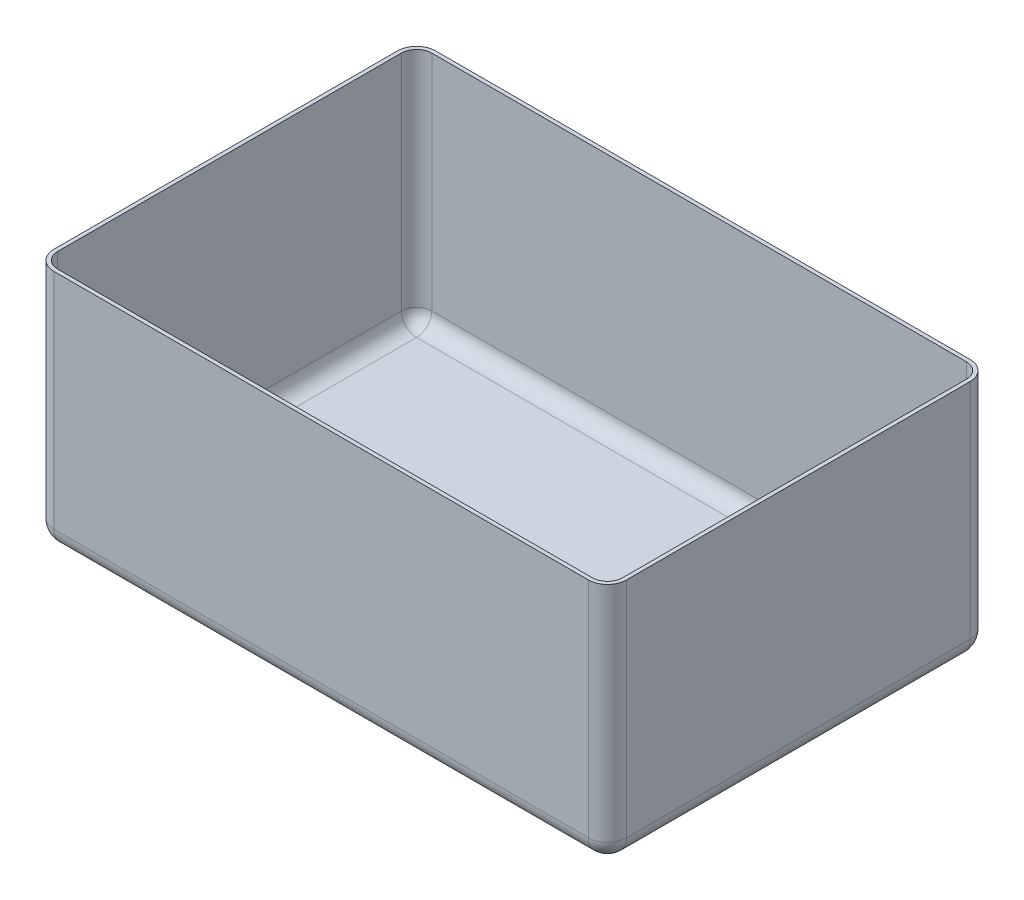
ISO-10303-21;
HEADER;
FILE_DESCRIPTION(('STEP AP214'),'2;1');
FILE_NAME('part.step','',(''),(''),'','','');
FILE_SCHEMA(('AUTOMOTIVE_DESIGN { 1 0 10303 214 1 1 1 1 }'));
ENDSEC;
DATA;
#1=APPLICATION_CONTEXT('core data for automotive mechanical design processes');
#2=APPLICATION_PROTOCOL_DEFINITION('international standard','automotive_design',2000,#1);
#3=PRODUCT_CONTEXT('',#1,'mechanical');
#4=PRODUCT('Part','Part','',(#3));
#5=PRODUCT_RELATED_PRODUCT_CATEGORY('part','',(#4));
#6=PRODUCT_DEFINITION_FORMATION('','',#4);
#7=PRODUCT_DEFINITION_CONTEXT('part definition',#1,'design');
#8=PRODUCT_DEFINITION('design','',#6,#7);
#9=PRODUCT_DEFINITION_SHAPE('','',#8);
#10=(LENGTH_UNIT() NAMED_UNIT(*) SI_UNIT(.MILLI.,.METRE.));
#11=(NAMED_UNIT(*) PLANE_ANGLE_UNIT() SI_UNIT($,.RADIAN.));
#12=(NAMED_UNIT(*) SI_UNIT($,.STERADIAN.) SOLID_ANGLE_UNIT());
#13=UNCERTAINTY_MEASURE_WITH_UNIT(LENGTH_MEASURE(1.E-05),#10,'distance_accuracy_value','');
#14=(GEOMETRIC_REPRESENTATION_CONTEXT(3) GLOBAL_UNCERTAINTY_ASSIGNED_CONTEXT((#13)) GLOBAL_UNIT_ASSIGNED_CONTEXT((#10,
#11,#12)) REPRESENTATION_CONTEXT('',''));
#15=CARTESIAN_POINT('',(0.,0.,0.));
#16=DIRECTION('',(0.,0.,1.));
#17=DIRECTION('',(1.,0.,0.));
#18=AXIS2_PLACEMENT_3D('',#15,#16,#17);
#19=CARTESIAN_POINT('',(0.,127.,0.));
#20=DIRECTION('',(0.,-1.,0.));
#21=DIRECTION('',(0.,0.,-1.));
#22=AXIS2_PLACEMENT_3D('',#19,#20,#21);
#23=PLANE('',#22);
#24=DIRECTION('',(-1.,0.,0.));
#25=VECTOR('',#24,1.);
#26=CARTESIAN_POINT('',(150.,127.,100.));
#27=LINE('',#26,#25);
#28=CARTESIAN_POINT('',(140.,127.,100.));
#29=VERTEX_POINT('',#28);
#30=CARTESIAN_POINT('',(-140.,127.,100.));
#31=VERTEX_POINT('',#30);
#32=EDGE_CURVE('E284',#29,#31,#27,.T.);
#33=ORIENTED_EDGE('',*,*,#32,.F.);
#34=CARTESIAN_POINT('',(140.,127.,90.));
#35=DIRECTION('',(0.,-1.,0.));
#36=DIRECTION('',(0.,0.,-1.));
#37=AXIS2_PLACEMENT_3D('',#34,#35,#36);
#38=CIRCLE('',#37,10.);
#39=CARTESIAN_POINT('',(150.,127.,90.));
#40=VERTEX_POINT('',#39);
#41=EDGE_CURVE('E11',#29,#40,#38,.F.);
#42=ORIENTED_EDGE('',*,*,#41,.T.);
#43=DIRECTION('',(0.,0.,-1.));
#44=VECTOR('',#43,1.);
#45=CARTESIAN_POINT('',(150.,127.,100.));
#46=LINE('',#45,#44);
#47=CARTESIAN_POINT('',(150.,127.,-90.));
#48=VERTEX_POINT('',#47);
#49=EDGE_CURVE('E287',#40,#48,#46,.T.);
#50=ORIENTED_EDGE('',*,*,#49,.T.);
#51=CARTESIAN_POINT('',(140.,127.,-90.));
#52=DIRECTION('',(0.,-1.,0.));
#53=DIRECTION('',(0.,0.,-1.));
#54=AXIS2_PLACEMENT_3D('',#51,#52,#53);
#55=CIRCLE('',#54,10.);
#56=CARTESIAN_POINT('',(140.,127.,-100.));
#57=VERTEX_POINT('',#56);
#58=EDGE_CURVE('E42',#48,#57,#55,.F.);
#59=ORIENTED_EDGE('',*,*,#58,.T.);
#60=DIRECTION('',(-1.,0.,0.));
#61=VECTOR('',#60,1.);
#62=CARTESIAN_POINT('',(150.,127.,-100.));
#63=LINE('',#62,#61);
#64=CARTESIAN_POINT('',(-140.,127.,-100.));
#65=VERTEX_POINT('',#64);
#66=EDGE_CURVE('E278',#57,#65,#63,.T.);
#67=ORIENTED_EDGE('',*,*,#66,.T.);
#68=CARTESIAN_POINT('',(-140.,127.,-90.));
#69=DIRECTION('',(0.,-1.,0.));
#70=DIRECTION('',(0.,0.,-1.));
#71=AXIS2_PLACEMENT_3D('',#68,#69,#70);
#72=CIRCLE('',#71,10.);
#73=CARTESIAN_POINT('',(-150.,127.,-90.));
#74=VERTEX_POINT('',#73);
#75=EDGE_CURVE('E325',#65,#74,#72,.F.);
#76=ORIENTED_EDGE('',*,*,#75,.T.);
#77=DIRECTION('',(0.,0.,-1.));
#78=VECTOR('',#77,1.);
#79=CARTESIAN_POINT('',(-150.,127.,100.));
#80=LINE('',#79,#78);
#81=CARTESIAN_POINT('',(-150.,127.,90.));
#82=VERTEX_POINT('',#81);
#83=EDGE_CURVE('E281',#82,#74,#80,.T.);
#84=ORIENTED_EDGE('',*,*,#83,.F.);
#85=CARTESIAN_POINT('',(-140.,127.,90.));
#86=DIRECTION('',(0.,-1.,0.));
#87=DIRECTION('',(0.,0.,-1.));
#88=AXIS2_PLACEMENT_3D('',#85,#86,#87);
#89=CIRCLE('',#88,10.);
#90=EDGE_CURVE('E323',#82,#31,#89,.F.);
#91=ORIENTED_EDGE('',*,*,#90,.T.);
#92=EDGE_LOOP('',(#33,#42,#50,#59,#67,#76,#84,#91));
#93=FACE_BOUND('',#92,.T.);
#94=CARTESIAN_POINT('',(140.,127.,90.));
#95=DIRECTION('',(0.,-1.,0.));
#96=DIRECTION('',(0.,0.,-1.));
#97=AXIS2_PLACEMENT_3D('',#94,#95,#96);
#98=CIRCLE('',#97,8.);
#99=CARTESIAN_POINT('',(140.,127.,98.));
#100=VERTEX_POINT('',#99);
#101=CARTESIAN_POINT('',(148.,127.,90.));
#102=VERTEX_POINT('',#101);
#103=EDGE_CURVE('E272',#100,#102,#98,.F.);
#104=ORIENTED_EDGE('',*,*,#103,.F.);
#105=DIRECTION('',(-1.,0.,0.));
#106=VECTOR('',#105,1.);
#107=CARTESIAN_POINT('',(0.,127.,98.));
#108=LINE('',#107,#106);
#109=CARTESIAN_POINT('',(-140.,127.,98.));
#110=VERTEX_POINT('',#109);
#111=EDGE_CURVE('E268',#100,#110,#108,.T.);
#112=ORIENTED_EDGE('',*,*,#111,.T.);
#113=CARTESIAN_POINT('',(-140.,127.,90.));
#114=DIRECTION('',(0.,-1.,0.));
#115=DIRECTION('',(0.,0.,-1.));
#116=AXIS2_PLACEMENT_3D('',#113,#114,#115);
#117=CIRCLE('',#116,8.);
#118=CARTESIAN_POINT('',(-148.,127.,90.));
#119=VERTEX_POINT('',#118);
#120=EDGE_CURVE('E184',#119,#110,#117,.F.);
#121=ORIENTED_EDGE('',*,*,#120,.F.);
#122=DIRECTION('',(0.,0.,-1.));
#123=VECTOR('',#122,1.);
#124=CARTESIAN_POINT('',(-148.,127.,0.));
#125=LINE('',#124,#123);
#126=CARTESIAN_POINT('',(-148.,127.,-90.));
#127=VERTEX_POINT('',#126);
#128=EDGE_CURVE('E50',#119,#127,#125,.T.);
#129=ORIENTED_EDGE('',*,*,#128,.T.);
#130=CARTESIAN_POINT('',(-140.,127.,-90.));
#131=DIRECTION('',(0.,-1.,0.));
#132=DIRECTION('',(0.,0.,-1.));
#133=AXIS2_PLACEMENT_3D('',#130,#131,#132);
#134=CIRCLE('',#133,8.);
#135=CARTESIAN_POINT('',(-140.,127.,-98.));
#136=VERTEX_POINT('',#135);
#137=EDGE_CURVE('E265',#136,#127,#134,.F.);
#138=ORIENTED_EDGE('',*,*,#137,.F.);
#139=DIRECTION('',(-1.,0.,0.));
#140=VECTOR('',#139,1.);
#141=CARTESIAN_POINT('',(0.,127.,-98.));
#142=LINE('',#141,#140);
#143=CARTESIAN_POINT('',(140.,127.,-98.));
#144=VERTEX_POINT('',#143);
#145=EDGE_CURVE('E224',#144,#136,#142,.T.);
#146=ORIENTED_EDGE('',*,*,#145,.F.);
#147=CARTESIAN_POINT('',(140.,127.,-90.));
#148=DIRECTION('',(0.,-1.,0.));
#149=DIRECTION('',(0.,0.,-1.));
#150=AXIS2_PLACEMENT_3D('',#147,#148,#149);
#151=CIRCLE('',#150,8.);
#152=CARTESIAN_POINT('',(148.,127.,-90.));
#153=VERTEX_POINT('',#152);
#154=EDGE_CURVE('E179',#153,#144,#151,.F.);
#155=ORIENTED_EDGE('',*,*,#154,.F.);
#156=DIRECTION('',(0.,0.,-1.));
#157=VECTOR('',#156,1.);
#158=CARTESIAN_POINT('',(148.,127.,0.));
#159=LINE('',#158,#157);
#160=EDGE_CURVE('E242',#102,#153,#159,.T.);
#161=ORIENTED_EDGE('',*,*,#160,.F.);
#162=EDGE_LOOP('',(#104,#112,#121,#129,#138,#146,#155,#161));
#163=FACE_BOUND('',#162,.T.);
#164=ADVANCED_FACE('F33',(#93,#163),#23,.F.);
#165=CARTESIAN_POINT('',(150.,127.,-100.));
#166=DIRECTION('',(0.,0.,1.));
#167=DIRECTION('',(1.,0.,0.));
#168=AXIS2_PLACEMENT_3D('',#165,#166,#167);
#169=PLANE('',#168);
#170=ORIENTED_EDGE('',*,*,#66,.F.);
#171=DIRECTION('',(0.,-1.,0.));
#172=VECTOR('',#171,1.);
#173=CARTESIAN_POINT('',(140.,127.,-100.));
#174=LINE('',#173,#172);
#175=CARTESIAN_POINT('',(140.,9.99999999999999,-100.));
#176=VERTEX_POINT('',#175);
#177=EDGE_CURVE('E58',#57,#176,#174,.T.);
#178=ORIENTED_EDGE('',*,*,#177,.T.);
#179=DIRECTION('',(-1.,0.,0.));
#180=VECTOR('',#179,1.);
#181=CARTESIAN_POINT('',(-150.,9.99999999999999,-100.));
#182=LINE('',#181,#180);
#183=CARTESIAN_POINT('',(-140.,9.99999999999999,-100.));
#184=VERTEX_POINT('',#183);
#185=EDGE_CURVE('E320',#176,#184,#182,.T.);
#186=ORIENTED_EDGE('',*,*,#185,.T.);
#187=DIRECTION('',(0.,-1.,0.));
#188=VECTOR('',#187,1.);
#189=CARTESIAN_POINT('',(-140.,127.,-100.));
#190=LINE('',#189,#188);
#191=EDGE_CURVE('E318',#184,#65,#190,.F.);
#192=ORIENTED_EDGE('',*,*,#191,.T.);
#193=EDGE_LOOP('',(#170,#178,#186,#192));
#194=FACE_BOUND('',#193,.T.);
#195=ADVANCED_FACE('F393',(#194),#169,.F.);
#196=CARTESIAN_POINT('',(-150.,127.,100.));
#197=DIRECTION('',(-1.,0.,0.));
#198=DIRECTION('',(0.,0.,1.));
#199=AXIS2_PLACEMENT_3D('',#196,#197,#198);
#200=PLANE('',#199);
#201=ORIENTED_EDGE('',*,*,#83,.T.);
#202=DIRECTION('',(0.,-1.,0.));
#203=VECTOR('',#202,1.);
#204=CARTESIAN_POINT('',(-150.,0.,-90.));
#205=LINE('',#204,#203);
#206=CARTESIAN_POINT('',(-150.,10.,-90.));
#207=VERTEX_POINT('',#206);
#208=EDGE_CURVE('E304',#74,#207,#205,.T.);
#209=ORIENTED_EDGE('',*,*,#208,.T.);
#210=DIRECTION('',(0.,0.,-1.));
#211=VECTOR('',#210,1.);
#212=CARTESIAN_POINT('',(-150.,9.99999999999999,100.));
#213=LINE('',#212,#211);
#214=CARTESIAN_POINT('',(-150.,10.,90.));
#215=VERTEX_POINT('',#214);
#216=EDGE_CURVE('E301',#207,#215,#213,.F.);
#217=ORIENTED_EDGE('',*,*,#216,.T.);
#218=DIRECTION('',(0.,-1.,0.));
#219=VECTOR('',#218,1.);
#220=CARTESIAN_POINT('',(-150.,127.,90.));
#221=LINE('',#220,#219);
#222=EDGE_CURVE('E299',#215,#82,#221,.F.);
#223=ORIENTED_EDGE('',*,*,#222,.T.);
#224=EDGE_LOOP('',(#201,#209,#217,#223));
#225=FACE_BOUND('',#224,.T.);
#226=ADVANCED_FACE('F410',(#225),#200,.T.);
#227=CARTESIAN_POINT('',(150.,127.,100.));
#228=DIRECTION('',(0.,0.,1.));
#229=DIRECTION('',(1.,0.,0.));
#230=AXIS2_PLACEMENT_3D('',#227,#228,#229);
#231=PLANE('',#230);
#232=DIRECTION('',(-1.,0.,0.));
#233=VECTOR('',#232,1.);
#234=CARTESIAN_POINT('',(150.,9.99999999999999,100.));
#235=LINE('',#234,#233);
#236=CARTESIAN_POINT('',(-140.,10.,100.));
#237=VERTEX_POINT('',#236);
#238=CARTESIAN_POINT('',(140.,10.,100.));
#239=VERTEX_POINT('',#238);
#240=EDGE_CURVE('E308',#237,#239,#235,.F.);
#241=ORIENTED_EDGE('',*,*,#240,.T.);
#242=DIRECTION('',(0.,-1.,0.));
#243=VECTOR('',#242,1.);
#244=CARTESIAN_POINT('',(140.,127.,100.));
#245=LINE('',#244,#243);
#246=EDGE_CURVE('E310',#239,#29,#245,.F.);
#247=ORIENTED_EDGE('',*,*,#246,.T.);
#248=ORIENTED_EDGE('',*,*,#32,.T.);
#249=DIRECTION('',(0.,-1.,0.));
#250=VECTOR('',#249,1.);
#251=CARTESIAN_POINT('',(-140.,127.,100.));
#252=LINE('',#251,#250);
#253=EDGE_CURVE('E306',#31,#237,#252,.T.);
#254=ORIENTED_EDGE('',*,*,#253,.T.);
#255=EDGE_LOOP('',(#241,#247,#248,#254));
#256=FACE_BOUND('',#255,.T.);
#257=ADVANCED_FACE('F418',(#256),#231,.T.);
#258=CARTESIAN_POINT('',(150.,127.,100.));
#259=DIRECTION('',(-1.,0.,0.));
#260=DIRECTION('',(0.,0.,1.));
#261=AXIS2_PLACEMENT_3D('',#258,#259,#260);
#262=PLANE('',#261);
#263=ORIENTED_EDGE('',*,*,#49,.F.);
#264=DIRECTION('',(0.,-1.,0.));
#265=VECTOR('',#264,1.);
#266=CARTESIAN_POINT('',(150.,0.,90.));
#267=LINE('',#266,#265);
#268=CARTESIAN_POINT('',(150.,9.99999999999999,90.));
#269=VERTEX_POINT('',#268);
#270=EDGE_CURVE('E316',#40,#269,#267,.T.);
#271=ORIENTED_EDGE('',*,*,#270,.T.);
#272=DIRECTION('',(0.,0.,-1.));
#273=VECTOR('',#272,1.);
#274=CARTESIAN_POINT('',(150.,9.99999999999999,-100.));
#275=LINE('',#274,#273);
#276=CARTESIAN_POINT('',(150.,9.99999999999999,-90.));
#277=VERTEX_POINT('',#276);
#278=EDGE_CURVE('E314',#269,#277,#275,.T.);
#279=ORIENTED_EDGE('',*,*,#278,.T.);
#280=DIRECTION('',(0.,-1.,0.));
#281=VECTOR('',#280,1.);
#282=CARTESIAN_POINT('',(150.,127.,-90.));
#283=LINE('',#282,#281);
#284=EDGE_CURVE('E312',#277,#48,#283,.F.);
#285=ORIENTED_EDGE('',*,*,#284,.T.);
#286=EDGE_LOOP('',(#263,#271,#279,#285));
#287=FACE_BOUND('',#286,.T.);
#288=ADVANCED_FACE('F384',(#287),#262,.F.);
#289=CARTESIAN_POINT('',(0.,0.,0.));
#290=DIRECTION('',(0.,-1.,0.));
#291=DIRECTION('',(0.,0.,-1.));
#292=AXIS2_PLACEMENT_3D('',#289,#290,#291);
#293=PLANE('',#292);
#294=DIRECTION('',(-1.,0.,0.));
#295=VECTOR('',#294,1.);
#296=CARTESIAN_POINT('',(0.,0.,90.));
#297=LINE('',#296,#295);
#298=CARTESIAN_POINT('',(140.,0.,90.));
#299=VERTEX_POINT('',#298);
#300=CARTESIAN_POINT('',(-140.,0.,90.));
#301=VERTEX_POINT('',#300);
#302=EDGE_CURVE('E294',#299,#301,#297,.T.);
#303=ORIENTED_EDGE('',*,*,#302,.T.);
#304=DIRECTION('',(0.,0.,-1.));
#305=VECTOR('',#304,1.);
#306=CARTESIAN_POINT('',(-140.,0.,0.));
#307=LINE('',#306,#305);
#308=CARTESIAN_POINT('',(-140.,0.,-90.));
#309=VERTEX_POINT('',#308);
#310=EDGE_CURVE('E296',#301,#309,#307,.T.);
#311=ORIENTED_EDGE('',*,*,#310,.T.);
#312=DIRECTION('',(-1.,0.,0.));
#313=VECTOR('',#312,1.);
#314=CARTESIAN_POINT('',(150.,0.,-90.));
#315=LINE('',#314,#313);
#316=CARTESIAN_POINT('',(140.,0.,-90.));
#317=VERTEX_POINT('',#316);
#318=EDGE_CURVE('E290',#309,#317,#315,.F.);
#319=ORIENTED_EDGE('',*,*,#318,.T.);
#320=DIRECTION('',(0.,0.,-1.));
#321=VECTOR('',#320,1.);
#322=CARTESIAN_POINT('',(140.,0.,100.));
#323=LINE('',#322,#321);
#324=EDGE_CURVE('E292',#317,#299,#323,.F.);
#325=ORIENTED_EDGE('',*,*,#324,.T.);
#326=EDGE_LOOP('',(#303,#311,#319,#325));
#327=FACE_BOUND('',#326,.T.);
#328=ADVANCED_FACE('F373',(#327),#293,.T.);
#329=CARTESIAN_POINT('',(140.,127.,90.));
#330=DIRECTION('',(0.,1.,0.));
#331=DIRECTION('',(0.,0.,1.));
#332=AXIS2_PLACEMENT_3D('',#329,#330,#331);
#333=CYLINDRICAL_SURFACE('',#332,10.);
#334=ORIENTED_EDGE('',*,*,#41,.F.);
#335=ORIENTED_EDGE('',*,*,#246,.F.);
#336=CARTESIAN_POINT('',(140.,9.99999999999999,90.));
#337=DIRECTION('',(0.,-1.,0.));
#338=DIRECTION('',(0.,0.,-1.));
#339=AXIS2_PLACEMENT_3D('',#336,#337,#338);
#340=CIRCLE('',#339,10.);
#341=EDGE_CURVE('E37',#269,#239,#340,.T.);
#342=ORIENTED_EDGE('',*,*,#341,.F.);
#343=ORIENTED_EDGE('',*,*,#270,.F.);
#344=EDGE_LOOP('',(#334,#335,#342,#343));
#345=FACE_BOUND('',#344,.T.);
#346=ADVANCED_FACE('F35',(#345),#333,.T.);
#347=CARTESIAN_POINT('',(140.,9.99999999999999,100.));
#348=DIRECTION('',(0.,0.,1.));
#349=DIRECTION('',(1.,0.,0.));
#350=AXIS2_PLACEMENT_3D('',#347,#348,#349);
#351=CYLINDRICAL_SURFACE('',#350,10.);
#352=CARTESIAN_POINT('',(140.,9.99999999999999,-90.));
#353=DIRECTION('',(0.,0.,-1.));
#354=DIRECTION('',(-1.,0.,0.));
#355=AXIS2_PLACEMENT_3D('',#352,#353,#354);
#356=CIRCLE('',#355,10.);
#357=EDGE_CURVE('E352',#277,#317,#356,.T.);
#358=ORIENTED_EDGE('',*,*,#357,.F.);
#359=ORIENTED_EDGE('',*,*,#278,.F.);
#360=CARTESIAN_POINT('',(140.,10.,90.));
#361=DIRECTION('',(0.,0.,1.));
#362=DIRECTION('',(1.,0.,0.));
#363=AXIS2_PLACEMENT_3D('',#360,#361,#362);
#364=CIRCLE('',#363,10.);
#365=EDGE_CURVE('E354',#299,#269,#364,.T.);
#366=ORIENTED_EDGE('',*,*,#365,.F.);
#367=ORIENTED_EDGE('',*,*,#324,.F.);
#368=EDGE_LOOP('',(#358,#359,#366,#367));
#369=FACE_BOUND('',#368,.T.);
#370=ADVANCED_FACE('F380',(#369),#351,.T.);
#371=CARTESIAN_POINT('',(140.,127.,-90.));
#372=DIRECTION('',(0.,-1.,0.));
#373=DIRECTION('',(0.,0.,-1.));
#374=AXIS2_PLACEMENT_3D('',#371,#372,#373);
#375=CYLINDRICAL_SURFACE('',#374,10.);
#376=ORIENTED_EDGE('',*,*,#58,.F.);
#377=ORIENTED_EDGE('',*,*,#284,.F.);
#378=CARTESIAN_POINT('',(140.,9.99999999999999,-90.));
#379=DIRECTION('',(0.,-1.,0.));
#380=DIRECTION('',(0.,0.,-1.));
#381=AXIS2_PLACEMENT_3D('',#378,#379,#380);
#382=CIRCLE('',#381,10.);
#383=EDGE_CURVE('E349',#176,#277,#382,.T.);
#384=ORIENTED_EDGE('',*,*,#383,.F.);
#385=ORIENTED_EDGE('',*,*,#177,.F.);
#386=EDGE_LOOP('',(#376,#377,#384,#385));
#387=FACE_BOUND('',#386,.T.);
#388=ADVANCED_FACE('F387',(#387),#375,.T.);
#389=CARTESIAN_POINT('',(140.,10.,90.));
#390=DIRECTION('',(0.,0.,1.));
#391=DIRECTION('',(1.,0.,0.));
#392=AXIS2_PLACEMENT_3D('',#389,#390,#391);
#393=SPHERICAL_SURFACE('',#392,10.);
#394=ORIENTED_EDGE('',*,*,#365,.T.);
#395=ORIENTED_EDGE('',*,*,#341,.T.);
#396=CARTESIAN_POINT('',(140.,10.,90.));
#397=DIRECTION('',(1.,0.,0.));
#398=DIRECTION('',(0.,0.,-1.));
#399=AXIS2_PLACEMENT_3D('',#396,#397,#398);
#400=CIRCLE('',#399,10.);
#401=EDGE_CURVE('E346',#299,#239,#400,.F.);
#402=ORIENTED_EDGE('',*,*,#401,.F.);
#403=EDGE_LOOP('',(#394,#395,#402));
#404=FACE_BOUND('',#403,.T.);
#405=ADVANCED_FACE('F361',(#404),#393,.T.);
#406=CARTESIAN_POINT('',(140.,10.,-90.));
#407=DIRECTION('',(0.,0.,1.));
#408=DIRECTION('',(1.,0.,0.));
#409=AXIS2_PLACEMENT_3D('',#406,#407,#408);
#410=SPHERICAL_SURFACE('',#409,10.);
#411=ORIENTED_EDGE('',*,*,#383,.T.);
#412=ORIENTED_EDGE('',*,*,#357,.T.);
#413=CARTESIAN_POINT('',(140.,10.,-90.));
#414=DIRECTION('',(1.,0.,0.));
#415=DIRECTION('',(0.,0.,-1.));
#416=AXIS2_PLACEMENT_3D('',#413,#414,#415);
#417=CIRCLE('',#416,10.);
#418=EDGE_CURVE('E343',#176,#317,#417,.F.);
#419=ORIENTED_EDGE('',*,*,#418,.F.);
#420=EDGE_LOOP('',(#411,#412,#419));
#421=FACE_BOUND('',#420,.T.);
#422=ADVANCED_FACE('F458',(#421),#410,.T.);
#423=CARTESIAN_POINT('',(-140.,127.,90.));
#424=DIRECTION('',(0.,-1.,0.));
#425=DIRECTION('',(0.,0.,-1.));
#426=AXIS2_PLACEMENT_3D('',#423,#424,#425);
#427=CYLINDRICAL_SURFACE('',#426,10.);
#428=ORIENTED_EDGE('',*,*,#90,.F.);
#429=ORIENTED_EDGE('',*,*,#222,.F.);
#430=CARTESIAN_POINT('',(-140.,10.,90.));
#431=DIRECTION('',(0.,-1.,0.));
#432=DIRECTION('',(0.,0.,-1.));
#433=AXIS2_PLACEMENT_3D('',#430,#431,#432);
#434=CIRCLE('',#433,10.);
#435=EDGE_CURVE('E340',#237,#215,#434,.T.);
#436=ORIENTED_EDGE('',*,*,#435,.F.);
#437=ORIENTED_EDGE('',*,*,#253,.F.);
#438=EDGE_LOOP('',(#428,#429,#436,#437));
#439=FACE_BOUND('',#438,.T.);
#440=ADVANCED_FACE('F416',(#439),#427,.T.);
#441=CARTESIAN_POINT('',(0.,10.,90.));
#442=DIRECTION('',(-1.,0.,0.));
#443=DIRECTION('',(0.,0.,1.));
#444=AXIS2_PLACEMENT_3D('',#441,#442,#443);
#445=CYLINDRICAL_SURFACE('',#444,10.);
#446=ORIENTED_EDGE('',*,*,#401,.T.);
#447=ORIENTED_EDGE('',*,*,#240,.F.);
#448=CARTESIAN_POINT('',(-140.,10.,90.));
#449=DIRECTION('',(-1.,0.,0.));
#450=DIRECTION('',(0.,0.,1.));
#451=AXIS2_PLACEMENT_3D('',#448,#449,#450);
#452=CIRCLE('',#451,10.);
#453=EDGE_CURVE('E337',#301,#237,#452,.T.);
#454=ORIENTED_EDGE('',*,*,#453,.F.);
#455=ORIENTED_EDGE('',*,*,#302,.F.);
#456=EDGE_LOOP('',(#446,#447,#454,#455));
#457=FACE_BOUND('',#456,.T.);
#458=ADVANCED_FACE('F368',(#457),#445,.T.);
#459=CARTESIAN_POINT('',(150.,9.99999999999999,-90.));
#460=DIRECTION('',(1.,0.,0.));
#461=DIRECTION('',(0.,0.,-1.));
#462=AXIS2_PLACEMENT_3D('',#459,#460,#461);
#463=CYLINDRICAL_SURFACE('',#462,10.);
#464=ORIENTED_EDGE('',*,*,#418,.T.);
#465=ORIENTED_EDGE('',*,*,#318,.F.);
#466=CARTESIAN_POINT('',(-140.,9.99999999999999,-90.));
#467=DIRECTION('',(-1.,0.,0.));
#468=DIRECTION('',(0.,0.,1.));
#469=AXIS2_PLACEMENT_3D('',#466,#467,#468);
#470=CIRCLE('',#469,10.);
#471=EDGE_CURVE('E334',#184,#309,#470,.T.);
#472=ORIENTED_EDGE('',*,*,#471,.F.);
#473=ORIENTED_EDGE('',*,*,#185,.F.);
#474=EDGE_LOOP('',(#464,#465,#472,#473));
#475=FACE_BOUND('',#474,.T.);
#476=ADVANCED_FACE('F403',(#475),#463,.T.);
#477=CARTESIAN_POINT('',(-140.,127.,-90.));
#478=DIRECTION('',(0.,1.,0.));
#479=DIRECTION('',(0.,0.,1.));
#480=AXIS2_PLACEMENT_3D('',#477,#478,#479);
#481=CYLINDRICAL_SURFACE('',#480,10.);
#482=ORIENTED_EDGE('',*,*,#75,.F.);
#483=ORIENTED_EDGE('',*,*,#191,.F.);
#484=CARTESIAN_POINT('',(-140.,10.,-90.));
#485=DIRECTION('',(0.,-1.,0.));
#486=DIRECTION('',(0.,0.,-1.));
#487=AXIS2_PLACEMENT_3D('',#484,#485,#486);
#488=CIRCLE('',#487,10.);
#489=EDGE_CURVE('E331',#207,#184,#488,.T.);
#490=ORIENTED_EDGE('',*,*,#489,.F.);
#491=ORIENTED_EDGE('',*,*,#208,.F.);
#492=EDGE_LOOP('',(#482,#483,#490,#491));
#493=FACE_BOUND('',#492,.T.);
#494=ADVANCED_FACE('F399',(#493),#481,.T.);
#495=CARTESIAN_POINT('',(-140.,10.,90.));
#496=DIRECTION('',(0.,0.,1.));
#497=DIRECTION('',(1.,0.,0.));
#498=AXIS2_PLACEMENT_3D('',#495,#496,#497);
#499=SPHERICAL_SURFACE('',#498,10.);
#500=ORIENTED_EDGE('',*,*,#453,.T.);
#501=ORIENTED_EDGE('',*,*,#435,.T.);
#502=CARTESIAN_POINT('',(-140.,10.,90.));
#503=DIRECTION('',(0.,0.,1.));
#504=DIRECTION('',(1.,0.,0.));
#505=AXIS2_PLACEMENT_3D('',#502,#503,#504);
#506=CIRCLE('',#505,10.);
#507=EDGE_CURVE('E329',#301,#215,#506,.F.);
#508=ORIENTED_EDGE('',*,*,#507,.F.);
#509=EDGE_LOOP('',(#500,#501,#508));
#510=FACE_BOUND('',#509,.T.);
#511=ADVANCED_FACE('F446',(#510),#499,.T.);
#512=CARTESIAN_POINT('',(-140.,10.,-90.));
#513=DIRECTION('',(0.,0.,1.));
#514=DIRECTION('',(1.,0.,0.));
#515=AXIS2_PLACEMENT_3D('',#512,#513,#514);
#516=SPHERICAL_SURFACE('',#515,10.);
#517=ORIENTED_EDGE('',*,*,#489,.T.);
#518=ORIENTED_EDGE('',*,*,#471,.T.);
#519=CARTESIAN_POINT('',(-140.,10.,-90.));
#520=DIRECTION('',(0.,0.,-1.));
#521=DIRECTION('',(-1.,0.,0.));
#522=AXIS2_PLACEMENT_3D('',#519,#520,#521);
#523=CIRCLE('',#522,10.);
#524=EDGE_CURVE('E274',#207,#309,#523,.F.);
#525=ORIENTED_EDGE('',*,*,#524,.F.);
#526=EDGE_LOOP('',(#517,#518,#525));
#527=FACE_BOUND('',#526,.T.);
#528=ADVANCED_FACE('F406',(#527),#516,.T.);
#529=CARTESIAN_POINT('',(-140.,10.,0.));
#530=DIRECTION('',(0.,0.,-1.));
#531=DIRECTION('',(-1.,0.,0.));
#532=AXIS2_PLACEMENT_3D('',#529,#530,#531);
#533=CYLINDRICAL_SURFACE('',#532,10.);
#534=ORIENTED_EDGE('',*,*,#507,.T.);
#535=ORIENTED_EDGE('',*,*,#216,.F.);
#536=ORIENTED_EDGE('',*,*,#524,.T.);
#537=ORIENTED_EDGE('',*,*,#310,.F.);
#538=EDGE_LOOP('',(#534,#535,#536,#537));
#539=FACE_BOUND('',#538,.T.);
#540=ADVANCED_FACE('F408',(#539),#533,.T.);
#541=CARTESIAN_POINT('',(150.,127.,-98.));
#542=DIRECTION('',(0.,0.,1.));
#543=DIRECTION('',(1.,0.,0.));
#544=AXIS2_PLACEMENT_3D('',#541,#542,#543);
#545=PLANE('',#544);
#546=ORIENTED_EDGE('',*,*,#145,.T.);
#547=DIRECTION('',(0.,1.,0.));
#548=VECTOR('',#547,1.);
#549=CARTESIAN_POINT('',(-140.,127.,-98.));
#550=LINE('',#549,#548);
#551=CARTESIAN_POINT('',(-140.,9.99999999999999,-98.));
#552=VERTEX_POINT('',#551);
#553=EDGE_CURVE('E207',#552,#136,#550,.T.);
#554=ORIENTED_EDGE('',*,*,#553,.F.);
#555=DIRECTION('',(1.,0.,0.));
#556=VECTOR('',#555,1.);
#557=CARTESIAN_POINT('',(150.,9.99999999999999,-98.));
#558=LINE('',#557,#556);
#559=CARTESIAN_POINT('',(140.,9.99999999999999,-98.));
#560=VERTEX_POINT('',#559);
#561=EDGE_CURVE('E185',#560,#552,#558,.F.);
#562=ORIENTED_EDGE('',*,*,#561,.F.);
#563=DIRECTION('',(0.,1.,0.));
#564=VECTOR('',#563,1.);
#565=CARTESIAN_POINT('',(140.,127.,-98.));
#566=LINE('',#565,#564);
#567=EDGE_CURVE('E174',#144,#560,#566,.F.);
#568=ORIENTED_EDGE('',*,*,#567,.F.);
#569=EDGE_LOOP('',(#546,#554,#562,#568));
#570=FACE_BOUND('',#569,.T.);
#571=ADVANCED_FACE('F206',(#570),#545,.T.);
#572=CARTESIAN_POINT('',(-148.,127.,100.));
#573=DIRECTION('',(-1.,0.,0.));
#574=DIRECTION('',(0.,0.,1.));
#575=AXIS2_PLACEMENT_3D('',#572,#573,#574);
#576=PLANE('',#575);
#577=ORIENTED_EDGE('',*,*,#128,.F.);
#578=DIRECTION('',(0.,1.,0.));
#579=VECTOR('',#578,1.);
#580=CARTESIAN_POINT('',(-148.,127.,90.));
#581=LINE('',#580,#579);
#582=CARTESIAN_POINT('',(-148.,10.,90.));
#583=VERTEX_POINT('',#582);
#584=EDGE_CURVE('E240',#583,#119,#581,.T.);
#585=ORIENTED_EDGE('',*,*,#584,.F.);
#586=DIRECTION('',(0.,0.,1.));
#587=VECTOR('',#586,1.);
#588=CARTESIAN_POINT('',(-148.,9.99999999999999,100.));
#589=LINE('',#588,#587);
#590=CARTESIAN_POINT('',(-148.,9.99999999999999,-90.));
#591=VERTEX_POINT('',#590);
#592=EDGE_CURVE('E253',#591,#583,#589,.T.);
#593=ORIENTED_EDGE('',*,*,#592,.F.);
#594=DIRECTION('',(0.,1.,0.));
#595=VECTOR('',#594,1.);
#596=CARTESIAN_POINT('',(-148.,127.,-90.));
#597=LINE('',#596,#595);
#598=EDGE_CURVE('E229',#127,#591,#597,.F.);
#599=ORIENTED_EDGE('',*,*,#598,.F.);
#600=EDGE_LOOP('',(#577,#585,#593,#599));
#601=FACE_BOUND('',#600,.T.);
#602=ADVANCED_FACE('F511',(#601),#576,.F.);
#603=CARTESIAN_POINT('',(150.,127.,98.));
#604=DIRECTION('',(0.,0.,1.));
#605=DIRECTION('',(1.,0.,0.));
#606=AXIS2_PLACEMENT_3D('',#603,#604,#605);
#607=PLANE('',#606);
#608=DIRECTION('',(1.,0.,0.));
#609=VECTOR('',#608,1.);
#610=CARTESIAN_POINT('',(150.,9.99999999999999,98.));
#611=LINE('',#610,#609);
#612=CARTESIAN_POINT('',(-140.,9.99999999999999,98.));
#613=VERTEX_POINT('',#612);
#614=CARTESIAN_POINT('',(140.,9.99999999999999,98.));
#615=VERTEX_POINT('',#614);
#616=EDGE_CURVE('E220',#613,#615,#611,.T.);
#617=ORIENTED_EDGE('',*,*,#616,.F.);
#618=DIRECTION('',(0.,1.,0.));
#619=VECTOR('',#618,1.);
#620=CARTESIAN_POINT('',(-140.,127.,98.));
#621=LINE('',#620,#619);
#622=EDGE_CURVE('E227',#110,#613,#621,.F.);
#623=ORIENTED_EDGE('',*,*,#622,.F.);
#624=ORIENTED_EDGE('',*,*,#111,.F.);
#625=DIRECTION('',(0.,1.,0.));
#626=VECTOR('',#625,1.);
#627=CARTESIAN_POINT('',(140.,127.,98.));
#628=LINE('',#627,#626);
#629=EDGE_CURVE('E215',#615,#100,#628,.T.);
#630=ORIENTED_EDGE('',*,*,#629,.F.);
#631=EDGE_LOOP('',(#617,#623,#624,#630));
#632=FACE_BOUND('',#631,.T.);
#633=ADVANCED_FACE('F518',(#632),#607,.F.);
#634=CARTESIAN_POINT('',(148.,127.,100.));
#635=DIRECTION('',(-1.,0.,0.));
#636=DIRECTION('',(0.,0.,1.));
#637=AXIS2_PLACEMENT_3D('',#634,#635,#636);
#638=PLANE('',#637);
#639=ORIENTED_EDGE('',*,*,#160,.T.);
#640=DIRECTION('',(0.,1.,0.));
#641=VECTOR('',#640,1.);
#642=CARTESIAN_POINT('',(148.,127.,-90.));
#643=LINE('',#642,#641);
#644=CARTESIAN_POINT('',(148.,9.99999999999999,-90.));
#645=VERTEX_POINT('',#644);
#646=EDGE_CURVE('E213',#645,#153,#643,.T.);
#647=ORIENTED_EDGE('',*,*,#646,.F.);
#648=DIRECTION('',(0.,0.,1.));
#649=VECTOR('',#648,1.);
#650=CARTESIAN_POINT('',(148.,9.99999999999999,100.));
#651=LINE('',#650,#649);
#652=CARTESIAN_POINT('',(148.,9.99999999999999,90.));
#653=VERTEX_POINT('',#652);
#654=EDGE_CURVE('E214',#653,#645,#651,.F.);
#655=ORIENTED_EDGE('',*,*,#654,.F.);
#656=DIRECTION('',(0.,1.,0.));
#657=VECTOR('',#656,1.);
#658=CARTESIAN_POINT('',(148.,127.,90.));
#659=LINE('',#658,#657);
#660=EDGE_CURVE('E210',#102,#653,#659,.F.);
#661=ORIENTED_EDGE('',*,*,#660,.F.);
#662=EDGE_LOOP('',(#639,#647,#655,#661));
#663=FACE_BOUND('',#662,.T.);
#664=ADVANCED_FACE('F525',(#663),#638,.T.);
#665=CARTESIAN_POINT('',(0.,2.,0.));
#666=DIRECTION('',(0.,-1.,0.));
#667=DIRECTION('',(0.,0.,-1.));
#668=AXIS2_PLACEMENT_3D('',#665,#666,#667);
#669=PLANE('',#668);
#670=DIRECTION('',(1.,0.,0.));
#671=VECTOR('',#670,1.);
#672=CARTESIAN_POINT('',(0.,2.,90.));
#673=LINE('',#672,#671);
#674=CARTESIAN_POINT('',(140.,2.,90.));
#675=VERTEX_POINT('',#674);
#676=CARTESIAN_POINT('',(-140.,2.,90.));
#677=VERTEX_POINT('',#676);
#678=EDGE_CURVE('E234',#675,#677,#673,.F.);
#679=ORIENTED_EDGE('',*,*,#678,.F.);
#680=DIRECTION('',(0.,0.,-1.));
#681=VECTOR('',#680,1.);
#682=CARTESIAN_POINT('',(140.,2.,0.));
#683=LINE('',#682,#681);
#684=CARTESIAN_POINT('',(140.,2.,-90.));
#685=VERTEX_POINT('',#684);
#686=EDGE_CURVE('E237',#685,#675,#683,.F.);
#687=ORIENTED_EDGE('',*,*,#686,.F.);
#688=DIRECTION('',(1.,0.,0.));
#689=VECTOR('',#688,1.);
#690=CARTESIAN_POINT('',(0.,2.,-90.));
#691=LINE('',#690,#689);
#692=CARTESIAN_POINT('',(-140.,2.,-90.));
#693=VERTEX_POINT('',#692);
#694=EDGE_CURVE('E202',#693,#685,#691,.T.);
#695=ORIENTED_EDGE('',*,*,#694,.F.);
#696=DIRECTION('',(0.,0.,-1.));
#697=VECTOR('',#696,1.);
#698=CARTESIAN_POINT('',(-140.,2.,0.));
#699=LINE('',#698,#697);
#700=EDGE_CURVE('E236',#677,#693,#699,.T.);
#701=ORIENTED_EDGE('',*,*,#700,.F.);
#702=EDGE_LOOP('',(#679,#687,#695,#701));
#703=FACE_BOUND('',#702,.T.);
#704=ADVANCED_FACE('F533',(#703),#669,.F.);
#705=CARTESIAN_POINT('',(140.,127.,90.));
#706=DIRECTION('',(0.,1.,0.));
#707=DIRECTION('',(0.,0.,1.));
#708=AXIS2_PLACEMENT_3D('',#705,#706,#707);
#709=CYLINDRICAL_SURFACE('',#708,8.);
#710=ORIENTED_EDGE('',*,*,#103,.T.);
#711=ORIENTED_EDGE('',*,*,#660,.T.);
#712=CARTESIAN_POINT('',(140.,10.,90.));
#713=DIRECTION('',(0.,-1.,0.));
#714=DIRECTION('',(0.,0.,-1.));
#715=AXIS2_PLACEMENT_3D('',#712,#713,#714);
#716=CIRCLE('',#715,8.);
#717=EDGE_CURVE('E221',#653,#615,#716,.T.);
#718=ORIENTED_EDGE('',*,*,#717,.T.);
#719=ORIENTED_EDGE('',*,*,#629,.T.);
#720=EDGE_LOOP('',(#710,#711,#718,#719));
#721=FACE_BOUND('',#720,.T.);
#722=ADVANCED_FACE('F541',(#721),#709,.F.);
#723=CARTESIAN_POINT('',(140.,9.99999999999999,100.));
#724=DIRECTION('',(0.,0.,1.));
#725=DIRECTION('',(1.,0.,0.));
#726=AXIS2_PLACEMENT_3D('',#723,#724,#725);
#727=CYLINDRICAL_SURFACE('',#726,8.);
#728=CARTESIAN_POINT('',(140.,10.,-90.));
#729=DIRECTION('',(0.,0.,1.));
#730=DIRECTION('',(1.,0.,0.));
#731=AXIS2_PLACEMENT_3D('',#728,#729,#730);
#732=CIRCLE('',#731,8.);
#733=EDGE_CURVE('E194',#645,#685,#732,.F.);
#734=ORIENTED_EDGE('',*,*,#733,.T.);
#735=ORIENTED_EDGE('',*,*,#686,.T.);
#736=CARTESIAN_POINT('',(140.,10.,90.));
#737=DIRECTION('',(0.,0.,1.));
#738=DIRECTION('',(1.,0.,0.));
#739=AXIS2_PLACEMENT_3D('',#736,#737,#738);
#740=CIRCLE('',#739,8.);
#741=EDGE_CURVE('E225',#675,#653,#740,.T.);
#742=ORIENTED_EDGE('',*,*,#741,.T.);
#743=ORIENTED_EDGE('',*,*,#654,.T.);
#744=EDGE_LOOP('',(#734,#735,#742,#743));
#745=FACE_BOUND('',#744,.T.);
#746=ADVANCED_FACE('F549',(#745),#727,.F.);
#747=CARTESIAN_POINT('',(140.,127.,-90.));
#748=DIRECTION('',(0.,-1.,0.));
#749=DIRECTION('',(0.,0.,-1.));
#750=AXIS2_PLACEMENT_3D('',#747,#748,#749);
#751=CYLINDRICAL_SURFACE('',#750,8.);
#752=ORIENTED_EDGE('',*,*,#154,.T.);
#753=ORIENTED_EDGE('',*,*,#567,.T.);
#754=CARTESIAN_POINT('',(140.,10.,-90.));
#755=DIRECTION('',(0.,-1.,0.));
#756=DIRECTION('',(1.,0.,0.));
#757=AXIS2_PLACEMENT_3D('',#754,#755,#756);
#758=CIRCLE('',#757,8.);
#759=EDGE_CURVE('E177',#560,#645,#758,.T.);
#760=ORIENTED_EDGE('',*,*,#759,.T.);
#761=ORIENTED_EDGE('',*,*,#646,.T.);
#762=EDGE_LOOP('',(#752,#753,#760,#761));
#763=FACE_BOUND('',#762,.T.);
#764=ADVANCED_FACE('F176',(#763),#751,.F.);
#765=CARTESIAN_POINT('',(140.,10.,90.));
#766=DIRECTION('',(0.,0.,1.));
#767=DIRECTION('',(1.,0.,0.));
#768=AXIS2_PLACEMENT_3D('',#765,#766,#767);
#769=SPHERICAL_SURFACE('',#768,8.);
#770=ORIENTED_EDGE('',*,*,#741,.F.);
#771=CARTESIAN_POINT('',(140.,10.,90.));
#772=DIRECTION('',(-1.,0.,0.));
#773=DIRECTION('',(0.,0.,1.));
#774=AXIS2_PLACEMENT_3D('',#771,#772,#773);
#775=CIRCLE('',#774,8.);
#776=EDGE_CURVE('E195',#675,#615,#775,.T.);
#777=ORIENTED_EDGE('',*,*,#776,.T.);
#778=ORIENTED_EDGE('',*,*,#717,.F.);
#779=EDGE_LOOP('',(#770,#777,#778));
#780=FACE_BOUND('',#779,.T.);
#781=ADVANCED_FACE('F564',(#780),#769,.F.);
#782=CARTESIAN_POINT('',(140.,10.,-90.));
#783=DIRECTION('',(0.,0.,1.));
#784=DIRECTION('',(1.,0.,0.));
#785=AXIS2_PLACEMENT_3D('',#782,#783,#784);
#786=SPHERICAL_SURFACE('',#785,8.);
#787=ORIENTED_EDGE('',*,*,#759,.F.);
#788=CARTESIAN_POINT('',(140.,9.99999999999999,-90.));
#789=DIRECTION('',(1.,0.,0.));
#790=DIRECTION('',(0.,0.,-1.));
#791=AXIS2_PLACEMENT_3D('',#788,#789,#790);
#792=CIRCLE('',#791,8.);
#793=EDGE_CURVE('E192',#560,#685,#792,.F.);
#794=ORIENTED_EDGE('',*,*,#793,.T.);
#795=ORIENTED_EDGE('',*,*,#733,.F.);
#796=EDGE_LOOP('',(#787,#794,#795));
#797=FACE_BOUND('',#796,.T.);
#798=ADVANCED_FACE('F191',(#797),#786,.F.);
#799=CARTESIAN_POINT('',(-140.,127.,90.));
#800=DIRECTION('',(0.,-1.,0.));
#801=DIRECTION('',(0.,0.,-1.));
#802=AXIS2_PLACEMENT_3D('',#799,#800,#801);
#803=CYLINDRICAL_SURFACE('',#802,8.);
#804=ORIENTED_EDGE('',*,*,#120,.T.);
#805=ORIENTED_EDGE('',*,*,#622,.T.);
#806=CARTESIAN_POINT('',(-140.,10.,90.));
#807=DIRECTION('',(0.,1.,0.));
#808=DIRECTION('',(-1.,0.,0.));
#809=AXIS2_PLACEMENT_3D('',#806,#807,#808);
#810=CIRCLE('',#809,8.);
#811=EDGE_CURVE('E204',#613,#583,#810,.F.);
#812=ORIENTED_EDGE('',*,*,#811,.T.);
#813=ORIENTED_EDGE('',*,*,#584,.T.);
#814=EDGE_LOOP('',(#804,#805,#812,#813));
#815=FACE_BOUND('',#814,.T.);
#816=ADVANCED_FACE('F578',(#815),#803,.F.);
#817=CARTESIAN_POINT('',(0.,10.,90.));
#818=DIRECTION('',(-1.,0.,0.));
#819=DIRECTION('',(0.,0.,1.));
#820=AXIS2_PLACEMENT_3D('',#817,#818,#819);
#821=CYLINDRICAL_SURFACE('',#820,8.);
#822=ORIENTED_EDGE('',*,*,#776,.F.);
#823=ORIENTED_EDGE('',*,*,#678,.T.);
#824=CARTESIAN_POINT('',(-140.,10.,90.));
#825=DIRECTION('',(-1.,0.,0.));
#826=DIRECTION('',(0.,-1.,0.));
#827=AXIS2_PLACEMENT_3D('',#824,#825,#826);
#828=CIRCLE('',#827,8.);
#829=EDGE_CURVE('E247',#677,#613,#828,.T.);
#830=ORIENTED_EDGE('',*,*,#829,.T.);
#831=ORIENTED_EDGE('',*,*,#616,.T.);
#832=EDGE_LOOP('',(#822,#823,#830,#831));
#833=FACE_BOUND('',#832,.T.);
#834=ADVANCED_FACE('F585',(#833),#821,.F.);
#835=CARTESIAN_POINT('',(150.,9.99999999999999,-90.));
#836=DIRECTION('',(1.,0.,0.));
#837=DIRECTION('',(0.,0.,-1.));
#838=AXIS2_PLACEMENT_3D('',#835,#836,#837);
#839=CYLINDRICAL_SURFACE('',#838,8.);
#840=ORIENTED_EDGE('',*,*,#793,.F.);
#841=ORIENTED_EDGE('',*,*,#561,.T.);
#842=CARTESIAN_POINT('',(-140.,10.,-90.));
#843=DIRECTION('',(-1.,0.,0.));
#844=DIRECTION('',(0.,-1.,0.));
#845=AXIS2_PLACEMENT_3D('',#842,#843,#844);
#846=CIRCLE('',#845,8.);
#847=EDGE_CURVE('E245',#552,#693,#846,.T.);
#848=ORIENTED_EDGE('',*,*,#847,.T.);
#849=ORIENTED_EDGE('',*,*,#694,.T.);
#850=EDGE_LOOP('',(#840,#841,#848,#849));
#851=FACE_BOUND('',#850,.T.);
#852=ADVANCED_FACE('F198',(#851),#839,.F.);
#853=CARTESIAN_POINT('',(-140.,127.,-90.));
#854=DIRECTION('',(0.,1.,0.));
#855=DIRECTION('',(0.,0.,1.));
#856=AXIS2_PLACEMENT_3D('',#853,#854,#855);
#857=CYLINDRICAL_SURFACE('',#856,8.);
#858=ORIENTED_EDGE('',*,*,#137,.T.);
#859=ORIENTED_EDGE('',*,*,#598,.T.);
#860=CARTESIAN_POINT('',(-140.,10.,-90.));
#861=DIRECTION('',(0.,1.,0.));
#862=DIRECTION('',(-1.,0.,0.));
#863=AXIS2_PLACEMENT_3D('',#860,#861,#862);
#864=CIRCLE('',#863,8.);
#865=EDGE_CURVE('E248',#591,#552,#864,.F.);
#866=ORIENTED_EDGE('',*,*,#865,.T.);
#867=ORIENTED_EDGE('',*,*,#553,.T.);
#868=EDGE_LOOP('',(#858,#859,#866,#867));
#869=FACE_BOUND('',#868,.T.);
#870=ADVANCED_FACE('F600',(#869),#857,.F.);
#871=CARTESIAN_POINT('',(-140.,10.,90.));
#872=DIRECTION('',(0.,0.,1.));
#873=DIRECTION('',(1.,0.,0.));
#874=AXIS2_PLACEMENT_3D('',#871,#872,#873);
#875=SPHERICAL_SURFACE('',#874,8.);
#876=ORIENTED_EDGE('',*,*,#829,.F.);
#877=CARTESIAN_POINT('',(-140.,10.,90.));
#878=DIRECTION('',(0.,0.,-1.));
#879=DIRECTION('',(-1.,0.,0.));
#880=AXIS2_PLACEMENT_3D('',#877,#878,#879);
#881=CIRCLE('',#880,8.);
#882=EDGE_CURVE('E251',#677,#583,#881,.T.);
#883=ORIENTED_EDGE('',*,*,#882,.T.);
#884=ORIENTED_EDGE('',*,*,#811,.F.);
#885=EDGE_LOOP('',(#876,#883,#884));
#886=FACE_BOUND('',#885,.T.);
#887=ADVANCED_FACE('F607',(#886),#875,.F.);
#888=CARTESIAN_POINT('',(-140.,10.,-90.));
#889=DIRECTION('',(0.,0.,1.));
#890=DIRECTION('',(1.,0.,0.));
#891=AXIS2_PLACEMENT_3D('',#888,#889,#890);
#892=SPHERICAL_SURFACE('',#891,8.);
#893=ORIENTED_EDGE('',*,*,#865,.F.);
#894=CARTESIAN_POINT('',(-140.,10.,-90.));
#895=DIRECTION('',(0.,0.,-1.));
#896=DIRECTION('',(-1.,0.,0.));
#897=AXIS2_PLACEMENT_3D('',#894,#895,#896);
#898=CIRCLE('',#897,8.);
#899=EDGE_CURVE('E262',#591,#693,#898,.F.);
#900=ORIENTED_EDGE('',*,*,#899,.T.);
#901=ORIENTED_EDGE('',*,*,#847,.F.);
#902=EDGE_LOOP('',(#893,#900,#901));
#903=FACE_BOUND('',#902,.T.);
#904=ADVANCED_FACE('F615',(#903),#892,.F.);
#905=CARTESIAN_POINT('',(-140.,10.,0.));
#906=DIRECTION('',(0.,0.,-1.));
#907=DIRECTION('',(-1.,0.,0.));
#908=AXIS2_PLACEMENT_3D('',#905,#906,#907);
#909=CYLINDRICAL_SURFACE('',#908,8.);
#910=ORIENTED_EDGE('',*,*,#882,.F.);
#911=ORIENTED_EDGE('',*,*,#700,.T.);
#912=ORIENTED_EDGE('',*,*,#899,.F.);
#913=ORIENTED_EDGE('',*,*,#592,.T.);
#914=EDGE_LOOP('',(#910,#911,#912,#913));
#915=FACE_BOUND('',#914,.T.);
#916=ADVANCED_FACE('F433',(#915),#909,.F.);
#917=CLOSED_SHELL('',(#164,#195,#226,#257,#288,#328,#346,#370,#388,#405,#422,#440,#458,#476,
#494,#511,#528,#540,#571,#602,#633,#664,#704,#722,#746,#764,#781,#798,#816,#834,#852,#870,#887,
#904,#916));
#918=MANIFOLD_SOLID_BREP('B2',#917);
#919=ADVANCED_BREP_SHAPE_REPRESENTATION('',(#18,#918),#14);
#920=SHAPE_DEFINITION_REPRESENTATION(#9,#919);
ENDSEC;
END-ISO-10303-21;
